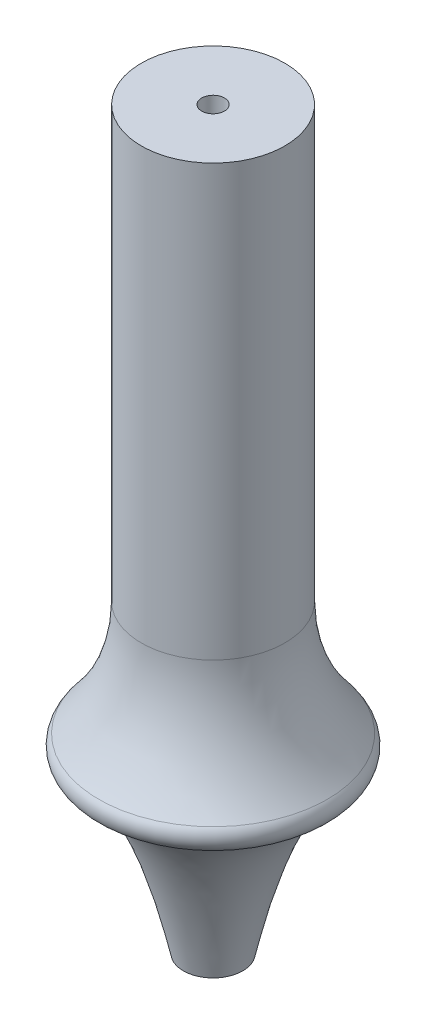
ISO-10303-21;
HEADER;
FILE_DESCRIPTION(('STEP AP214'),'2;1');
FILE_NAME('part.step','',(''),(''),'','','');
FILE_SCHEMA(('AUTOMOTIVE_DESIGN { 1 0 10303 214 1 1 1 1 }'));
ENDSEC;
DATA;
#1=APPLICATION_CONTEXT('core data for automotive mechanical design processes');
#2=APPLICATION_PROTOCOL_DEFINITION('international standard','automotive_design',2000,#1);
#3=PRODUCT_CONTEXT('',#1,'mechanical');
#4=PRODUCT('Part','Part','',(#3));
#5=PRODUCT_RELATED_PRODUCT_CATEGORY('part','',(#4));
#6=PRODUCT_DEFINITION_FORMATION('','',#4);
#7=PRODUCT_DEFINITION_CONTEXT('part definition',#1,'design');
#8=PRODUCT_DEFINITION('design','',#6,#7);
#9=PRODUCT_DEFINITION_SHAPE('','',#8);
#10=(LENGTH_UNIT() NAMED_UNIT(*) SI_UNIT(.MILLI.,.METRE.));
#11=(NAMED_UNIT(*) PLANE_ANGLE_UNIT() SI_UNIT($,.RADIAN.));
#12=(NAMED_UNIT(*) SI_UNIT($,.STERADIAN.) SOLID_ANGLE_UNIT());
#13=UNCERTAINTY_MEASURE_WITH_UNIT(LENGTH_MEASURE(1.E-05),#10,'distance_accuracy_value','');
#14=(GEOMETRIC_REPRESENTATION_CONTEXT(3) GLOBAL_UNCERTAINTY_ASSIGNED_CONTEXT((#13)) GLOBAL_UNIT_ASSIGNED_CONTEXT((#10,
#11,#12)) REPRESENTATION_CONTEXT('',''));
#15=CARTESIAN_POINT('',(0.,0.,0.));
#16=DIRECTION('',(0.,0.,1.));
#17=DIRECTION('',(1.,0.,0.));
#18=AXIS2_PLACEMENT_3D('',#15,#16,#17);
#19=CARTESIAN_POINT('',(0.,2.68267316592833,0.));
#20=DIRECTION('',(0.,-1.,0.));
#21=DIRECTION('',(0.,0.,-1.));
#22=AXIS2_PLACEMENT_3D('',#19,#20,#21);
#23=TOROIDAL_SURFACE('',#22,14.3035796510438,2.14316562189979);
#24=CARTESIAN_POINT('',(0.,0.605800000000004,0.));
#25=DIRECTION('',(0.,-1.,0.));
#26=DIRECTION('',(0.,0.,-1.));
#27=AXIS2_PLACEMENT_3D('',#24,#25,#26);
#28=CIRCLE('',#27,14.8325);
#29=CARTESIAN_POINT('',(0.,0.605800000000004,-14.8325));
#30=VERTEX_POINT('',#29);
#31=EDGE_CURVE('E10',#30,#30,#28,.T.);
#32=ORIENTED_EDGE('',*,*,#31,.F.);
#33=EDGE_LOOP('',(#32));
#34=FACE_BOUND('',#33,.T.);
#35=CARTESIAN_POINT('',(0.,4.08412944259515,0.));
#36=DIRECTION('',(0.,-1.,0.));
#37=DIRECTION('',(0.,0.,-1.));
#38=AXIS2_PLACEMENT_3D('',#35,#36,#37);
#39=CIRCLE('',#38,15.9250232015519);
#40=CARTESIAN_POINT('',(0.,4.08412944259515,-15.9250232015519));
#41=VERTEX_POINT('',#40);
#42=EDGE_CURVE('E60',#41,#41,#39,.T.);
#43=ORIENTED_EDGE('',*,*,#42,.T.);
#44=EDGE_LOOP('',(#43));
#45=FACE_BOUND('',#44,.T.);
#46=ADVANCED_FACE('F35',(#34,#45),#23,.T.);
#47=CARTESIAN_POINT('',(0.,0.6058,14.8325));
#48=CARTESIAN_POINT('',(0.,0.594107912206373,14.7865895270144));
#49=CARTESIAN_POINT('',(0.,0.577188139103916,14.7201518813473));
#50=CARTESIAN_POINT('',(0.,0.555651214039472,14.6369424777007));
#51=CARTESIAN_POINT('',(0.,0.541606050783031,14.5846289830644));
#52=CARTESIAN_POINT('',(0.,0.529056302239419,14.5386947822118));
#53=CARTESIAN_POINT('',(0.,0.516807177505447,14.4961158928496));
#54=CARTESIAN_POINT('',(0.,0.504752713045072,14.4553773234105));
#55=CARTESIAN_POINT('',(0.,0.492601585785411,14.4157038858794));
#56=CARTESIAN_POINT('',(0.,0.480213977650478,14.3766087246224));
#57=CARTESIAN_POINT('',(0.,0.467258765104925,14.3378230659763));
#58=CARTESIAN_POINT('',(0.,0.453804958758428,14.2990732958135));
#59=CARTESIAN_POINT('',(0.,0.439967713657216,14.2600774768196));
#60=CARTESIAN_POINT('',(0.,0.425142488790428,14.2208329363449));
#61=CARTESIAN_POINT('',(0.,0.4098284985807,14.1810035447542));
#62=CARTESIAN_POINT('',(0.,0.393427939959309,14.1406392257569));
#63=CARTESIAN_POINT('',(0.,0.376264866104305,14.0995398273927));
#64=CARTESIAN_POINT('',(0.,0.358051467963397,14.0576431881332));
#65=CARTESIAN_POINT('',(0.,0.338576094782098,14.0150036261546));
#66=CARTESIAN_POINT('',(0.,0.318244003719504,13.971270318355));
#67=CARTESIAN_POINT('',(0.,0.296334647509333,13.9267164776812));
#68=CARTESIAN_POINT('',(0.,0.273357563658569,13.8809173400225));
#69=CARTESIAN_POINT('',(0.,0.248879897051767,13.8340124492675));
#70=CARTESIAN_POINT('',(0.,0.222646856256437,13.785997303938));
#71=CARTESIAN_POINT('',(0.,0.195147367380525,13.7365455109421));
#72=CARTESIAN_POINT('',(0.,0.165637059045072,13.6858804172271));
#73=CARTESIAN_POINT('',(0.,0.134329980775806,13.6338325600107));
#74=CARTESIAN_POINT('',(0.,0.101238986386573,13.5802022354748));
#75=CARTESIAN_POINT('',(0.,0.0658290973155611,13.5251969847291));
#76=CARTESIAN_POINT('',(0.,0.0283943757511445,13.4684899779255));
#77=CARTESIAN_POINT('',(0.,-0.0115279815246818,13.4102184968625));
#78=CARTESIAN_POINT('',(0.,-0.053791022533644,13.3501682777678));
#79=CARTESIAN_POINT('',(0.,-0.0989003105572554,13.2884706537331));
#80=CARTESIAN_POINT('',(0.,-0.146603334827948,13.224788811436));
#81=CARTESIAN_POINT('',(0.,-0.197326807689376,13.1592412073682));
#82=CARTESIAN_POINT('',(0.,-0.25134118131284,13.0918552957949));
#83=CARTESIAN_POINT('',(0.,-0.308401649274786,13.0222335221298));
#84=CARTESIAN_POINT('',(0.,-0.369268692635678,12.9507331865607));
#85=CARTESIAN_POINT('',(0.,-0.433607317218442,12.8768449795842));
#86=CARTESIAN_POINT('',(0.,-0.502166919636169,12.8009428332164));
#87=CARTESIAN_POINT('',(0.,-0.574690204109054,12.7225588793487));
#88=CARTESIAN_POINT('',(0.,-0.651653184331904,12.6418064704389));
#89=CARTESIAN_POINT('',(0.,-0.733330072405864,12.5586317125741));
#90=CARTESIAN_POINT('',(0.,-0.820056033341306,12.4730078627439));
#91=CARTESIAN_POINT('',(0.,-0.911877966577275,12.3846066555786));
#92=CARTESIAN_POINT('',(0.,-1.00941352533373,12.2936559430722));
#93=CARTESIAN_POINT('',(0.,-1.11280957769506,12.1999366202946));
#94=CARTESIAN_POINT('',(0.,-1.22229215791659,12.1031812344031));
#95=CARTESIAN_POINT('',(0.,-1.33855084981937,12.0036585887043));
#96=CARTESIAN_POINT('',(0.,-1.4616943659355,11.901000776834));
#97=CARTESIAN_POINT('',(0.,-1.59227219099499,11.795279130824));
#98=CARTESIAN_POINT('',(0.,-1.73073886868532,11.6864285163609));
#99=CARTESIAN_POINT('',(0.,-1.8774098940514,11.5741526932877));
#100=CARTESIAN_POINT('',(0.,-2.03292930547564,11.4585363944359));
#101=CARTESIAN_POINT('',(0.,-2.19775156618193,11.3394410786376));
#102=CARTESIAN_POINT('',(0.,-2.37258693814505,11.2169063056099));
#103=CARTESIAN_POINT('',(0.,-2.55771815912039,11.0904562327673));
#104=CARTESIAN_POINT('',(0.,-2.75407846705841,10.9603393723807));
#105=CARTESIAN_POINT('',(0.,-2.96226792085158,10.8264031349356));
#106=CARTESIAN_POINT('',(0.,-3.18288167787418,10.6883222135904));
#107=CARTESIAN_POINT('',(0.,-3.41688237704983,10.5463887987382));
#108=CARTESIAN_POINT('',(0.,-3.66485353168699,10.3999820056218));
#109=CARTESIAN_POINT('',(0.,-3.92789389440654,10.2493813351734));
#110=CARTESIAN_POINT('',(0.,-4.20696952602156,10.0945336154804));
#111=CARTESIAN_POINT('',(0.,-4.50278114437961,9.93478729038151));
#112=CARTESIAN_POINT('',(0.,-4.81672002941785,9.77060052593263));
#113=CARTESIAN_POINT('',(0.,-5.14984667526825,9.60169236533696));
#114=CARTESIAN_POINT('',(0.,-5.50326598993471,9.42766193069263));
#115=CARTESIAN_POINT('',(0.,-5.87847567355671,9.24877596524616));
#116=CARTESIAN_POINT('',(0.,-6.27683523776239,9.06464590052695));
#117=CARTESIAN_POINT('',(0.,-6.69990287224116,8.87533318954772));
#118=CARTESIAN_POINT('',(0.,-7.14934112072802,8.68051663843084));
#119=CARTESIAN_POINT('',(0.,-7.6268977172647,8.48011918189116));
#120=CARTESIAN_POINT('',(0.,-8.13459334514917,8.27419422024078));
#121=CARTESIAN_POINT('',(0.,-8.67434194197511,8.0621736969138));
#122=CARTESIAN_POINT('',(0.,-9.24861769698138,7.84447304620219));
#123=CARTESIAN_POINT('',(0.,-9.85965235775611,7.62037854638359));
#124=CARTESIAN_POINT('',(0.,-10.5102391617322,7.39014363419455));
#125=CARTESIAN_POINT('',(0.,-11.2032639249178,7.15351637005612));
#126=CARTESIAN_POINT('',(0.,-11.9418162721898,6.91022293020803));
#127=CARTESIAN_POINT('',(0.,-12.7294073166303,6.66040936588325));
#128=CARTESIAN_POINT('',(0.,-13.5696190221014,6.40346386788496));
#129=CARTESIAN_POINT('',(0.,-14.4666607467803,6.13955877045744));
#130=CARTESIAN_POINT('',(0.,-15.4250458713218,5.86859751032395));
#131=CARTESIAN_POINT('',(0.,-16.4495749999204,5.58995817963725));
#132=CARTESIAN_POINT('',(0.,-17.5458705102198,5.30410545004161));
#133=CARTESIAN_POINT('',(0.,-18.7197166221722,5.01024616877044));
#134=CARTESIAN_POINT('',(0.,-19.9778842864661,4.70867968386833));
#135=CARTESIAN_POINT('',(0.,-21.3276376225704,4.39896998246256));
#136=CARTESIAN_POINT('',(0.,-22.7771278799972,4.08085745443413));
#137=CARTESIAN_POINT('',(0.,-24.3354951914395,3.75451345665229));
#138=CARTESIAN_POINT('',(0.,-26.0128583612171,3.41952793014153));
#139=CARTESIAN_POINT('',(0.,-27.8205528786836,3.07551702579519));
#140=CARTESIAN_POINT('',(0.,-29.7714222503555,2.72268418173031));
#141=CARTESIAN_POINT('',(0.,-31.879838305188,2.3605318164329));
#142=CARTESIAN_POINT('',(0.,-34.1621626622238,1.98897467652366));
#143=CARTESIAN_POINT('',(0.,-36.636974891812,1.60771551425199));
#144=CARTESIAN_POINT('',(0.,-39.3254802947712,1.21675626011374));
#145=CARTESIAN_POINT('',(0.,-42.2520163579807,0.815801597413454));
#146=CARTESIAN_POINT('',(0.,-45.4444157506613,0.403306983076827));
#147=CARTESIAN_POINT('',(0.,-47.6660568580291,0.138325748640901));
#148=CARTESIAN_POINT('',(0.,-48.8258,0.));
#149=B_SPLINE_CURVE_WITH_KNOTS('',3,(#47,#48,#49,#50,#51,#52,#53,#54,#55,#56,#57,#58,#59,#60,
#61,#62,#63,#64,#65,#66,#67,#68,#69,#70,#71,#72,#73,#74,#75,#76,#77,#78,#79,#80,#81,#82,#83,#84,
#85,#86,#87,#88,#89,#90,#91,#92,#93,#94,#95,#96,#97,#98,#99,#100,#101,#102,#103,#104,#105,#106,
#107,#108,#109,#110,#111,#112,#113,#114,#115,#116,#117,#118,#119,#120,#121,#122,#123,#124,#125,
#126,#127,#128,#129,#130,#131,#132,#133,#134,#135,#136,#137,#138,#139,#140,#141,#142,#143,#144,
#145,#146,#147,#148),.UNSPECIFIED.,.F.,.F.,(4,1,1,1,1,1,1,1,1,1,1,1,1,1,1,1,1,1,1,1,1,1,1,1,1,1,
1,1,1,1,1,1,1,1,1,1,1,1,1,1,1,1,1,1,1,1,1,1,1,1,1,1,1,1,1,1,1,1,1,1,1,1,1,1,1,1,1,1,1,1,1,1,1,1,
1,1,1,1,1,1,1,1,1,1,1,1,1,1,1,1,1,1,1,1,1,1,1,1,1,4),(0.,0.00268639971786465,
0.00388752415232042,0.00487373134743466,0.00575781270420472,0.00658758786129885,
0.00738598551822443,0.00816683064805866,0.00894034377952946,0.00971139124040117,
0.0104854791803002,0.0112662694048164,0.0120575835173272,0.0128642058125804,0.0136858750454206,
0.0145280011426551,0.0153897174782899,0.0162761959487741,0.017186037284947,0.0181243487028412,
0.0190913652745111,0.0200915024237446,0.0211242135235046,0.0221937859605704,0.023299910267619,
0.024448713701066,0.0256378225610593,0.0268730893421841,0.0281579793861846,0.029490658260886,
0.030878235533799,0.0323216666491402,0.0338243190503442,0.0353899048795117,0.0370211167018488,
0.0387212515780134,0.0404940211099502,0.0423453634405956,0.0442765691925014,0.0462935359064858,
0.0484005081925963,0.0506018526936621,0.0529033839282631,0.055310916158337,0.0578290877441769,
0.0604651622387457,0.0632237092344786,0.0661137810787376,0.0691427306257942,0.0723142924187423,
0.0756402924170954,0.079129636062662,0.082787821063172,0.0866284162916928,0.090659818227387,
0.0948937358653085,0.0993407719387853,0.104016432969499,0.10893049778877,0.114098239225188,
0.119534774427684,0.125258903679969,0.13128473184462,0.137631752293137,0.144321680770213,
0.151373222436024,0.158810235369236,0.166659266463232,0.17494277725284,0.183694449195439,
0.192940456247835,0.202718270686926,0.21306062028016,0.224006047428867,0.235599981204905,
0.247884807623142,0.260909978029779,0.274731834388955,0.289408721084207,0.305001629052581,
0.321583098658407,0.339229091768819,0.358021890550831,0.378056498764504,0.399433010339709,
0.422263422708781,0.446671009039493,0.472795467262415,0.500787451756706,0.530817523019995,
0.563076364208029,0.597777275001215,0.635158941175366,0.67549134588414,0.719081884943624,
0.766277674896637,0.817476572882521,0.873132107831789,0.933772305801132,1.),.UNSPECIFIED.);
#150=CARTESIAN_POINT('',(0.,-48.8258,0.));
#151=DIRECTION('',(0.,-1.,0.));
#152=AXIS1_PLACEMENT('',#150,#151);
#153=SURFACE_OF_REVOLUTION('',#149,#152);
#154=CARTESIAN_POINT('',(0.,-22.5,0.));
#155=DIRECTION('',(0.,-1.,0.));
#156=DIRECTION('',(0.,0.,-1.));
#157=AXIS2_PLACEMENT_3D('',#154,#155,#156);
#158=CIRCLE('',#157,4.14304083359019);
#159=CARTESIAN_POINT('',(0.,-22.5,-4.14304083359019));
#160=VERTEX_POINT('',#159);
#161=EDGE_CURVE('E41',#160,#160,#158,.T.);
#162=ORIENTED_EDGE('',*,*,#161,.F.);
#163=EDGE_LOOP('',(#162));
#164=FACE_BOUND('',#163,.T.);
#165=ORIENTED_EDGE('',*,*,#31,.T.);
#166=EDGE_LOOP('',(#165));
#167=FACE_BOUND('',#166,.T.);
#168=ADVANCED_FACE('F69',(#164,#167),#153,.T.);
#169=CARTESIAN_POINT('',(0.,-22.5,0.));
#170=DIRECTION('',(0.,-1.,0.));
#171=DIRECTION('',(0.,0.,-1.));
#172=AXIS2_PLACEMENT_3D('',#169,#170,#171);
#173=PLANE('',#172);
#174=ORIENTED_EDGE('',*,*,#161,.T.);
#175=EDGE_LOOP('',(#174));
#176=FACE_BOUND('',#175,.T.);
#177=CARTESIAN_POINT('',(0.,-22.5,0.));
#178=DIRECTION('',(0.,-1.,0.));
#179=DIRECTION('',(0.,0.,-1.));
#180=AXIS2_PLACEMENT_3D('',#177,#178,#179);
#181=CIRCLE('',#180,1.5875);
#182=CARTESIAN_POINT('',(0.,-22.5,-1.5875));
#183=VERTEX_POINT('',#182);
#184=EDGE_CURVE('E45',#183,#183,#181,.T.);
#185=ORIENTED_EDGE('',*,*,#184,.F.);
#186=EDGE_LOOP('',(#185));
#187=FACE_BOUND('',#186,.T.);
#188=ADVANCED_FACE('F72',(#176,#187),#173,.T.);
#189=CARTESIAN_POINT('',(0.,-48.8258,0.));
#190=DIRECTION('',(0.,-1.,0.));
#191=DIRECTION('',(0.,0.,-1.));
#192=AXIS2_PLACEMENT_3D('',#189,#190,#191);
#193=CYLINDRICAL_SURFACE('',#192,1.5875);
#194=ORIENTED_EDGE('',*,*,#184,.T.);
#195=EDGE_LOOP('',(#194));
#196=FACE_BOUND('',#195,.T.);
#197=CARTESIAN_POINT('',(0.,79.9840268711891,0.));
#198=DIRECTION('',(0.,-1.,0.));
#199=DIRECTION('',(0.,0.,-1.));
#200=AXIS2_PLACEMENT_3D('',#197,#198,#199);
#201=CIRCLE('',#200,1.58750000000001);
#202=CARTESIAN_POINT('',(0.,79.9840268711891,-1.58750000000001));
#203=VERTEX_POINT('',#202);
#204=EDGE_CURVE('E49',#203,#203,#201,.T.);
#205=ORIENTED_EDGE('',*,*,#204,.F.);
#206=EDGE_LOOP('',(#205));
#207=FACE_BOUND('',#206,.T.);
#208=ADVANCED_FACE('F76',(#196,#207),#193,.F.);
#209=CARTESIAN_POINT('',(0.,79.9840268711891,0.));
#210=DIRECTION('',(0.,1.,0.));
#211=DIRECTION('',(0.,0.,1.));
#212=AXIS2_PLACEMENT_3D('',#209,#210,#211);
#213=PLANE('',#212);
#214=ORIENTED_EDGE('',*,*,#204,.T.);
#215=EDGE_LOOP('',(#214));
#216=FACE_BOUND('',#215,.T.);
#217=CARTESIAN_POINT('',(0.,79.9840268711891,0.));
#218=DIRECTION('',(0.,-1.,0.));
#219=DIRECTION('',(0.,0.,-1.));
#220=AXIS2_PLACEMENT_3D('',#217,#218,#219);
#221=CIRCLE('',#220,10.);
#222=CARTESIAN_POINT('',(0.,79.9840268711891,-10.));
#223=VERTEX_POINT('',#222);
#224=EDGE_CURVE('E54',#223,#223,#221,.T.);
#225=ORIENTED_EDGE('',*,*,#224,.F.);
#226=EDGE_LOOP('',(#225));
#227=FACE_BOUND('',#226,.T.);
#228=ADVANCED_FACE('F79',(#216,#227),#213,.T.);
#229=CARTESIAN_POINT('',(0.,-48.8258,0.));
#230=DIRECTION('',(0.,-1.,0.));
#231=DIRECTION('',(0.,0.,-1.));
#232=AXIS2_PLACEMENT_3D('',#229,#230,#231);
#233=CYLINDRICAL_SURFACE('',#232,10.);
#234=ORIENTED_EDGE('',*,*,#224,.T.);
#235=EDGE_LOOP('',(#234));
#236=FACE_BOUND('',#235,.T.);
#237=CARTESIAN_POINT('',(0.,20.,0.));
#238=DIRECTION('',(0.,-1.,0.));
#239=DIRECTION('',(0.,0.,-1.));
#240=AXIS2_PLACEMENT_3D('',#237,#238,#239);
#241=CIRCLE('',#240,10.);
#242=CARTESIAN_POINT('',(0.,20.,-10.));
#243=VERTEX_POINT('',#242);
#244=EDGE_CURVE('E57',#243,#243,#241,.T.);
#245=ORIENTED_EDGE('',*,*,#244,.F.);
#246=EDGE_LOOP('',(#245));
#247=FACE_BOUND('',#246,.T.);
#248=ADVANCED_FACE('F83',(#236,#247),#233,.T.);
#249=CARTESIAN_POINT('',(0.,20.,0.));
#250=DIRECTION('',(0.,-1.,0.));
#251=DIRECTION('',(0.,0.,-1.));
#252=AXIS2_PLACEMENT_3D('',#249,#250,#251);
#253=TOROIDAL_SURFACE('',#252,34.3392157066533,24.3392157066533);
#254=ORIENTED_EDGE('',*,*,#244,.T.);
#255=EDGE_LOOP('',(#254));
#256=FACE_BOUND('',#255,.T.);
#257=ORIENTED_EDGE('',*,*,#42,.F.);
#258=EDGE_LOOP('',(#257));
#259=FACE_BOUND('',#258,.T.);
#260=ADVANCED_FACE('F87',(#256,#259),#253,.F.);
#261=CLOSED_SHELL('',(#46,#168,#188,#208,#228,#248,#260));
#262=MANIFOLD_SOLID_BREP('B2',#261);
#263=ADVANCED_BREP_SHAPE_REPRESENTATION('',(#18,#262),#14);
#264=SHAPE_DEFINITION_REPRESENTATION(#9,#263);
ENDSEC;
END-ISO-10303-21;
